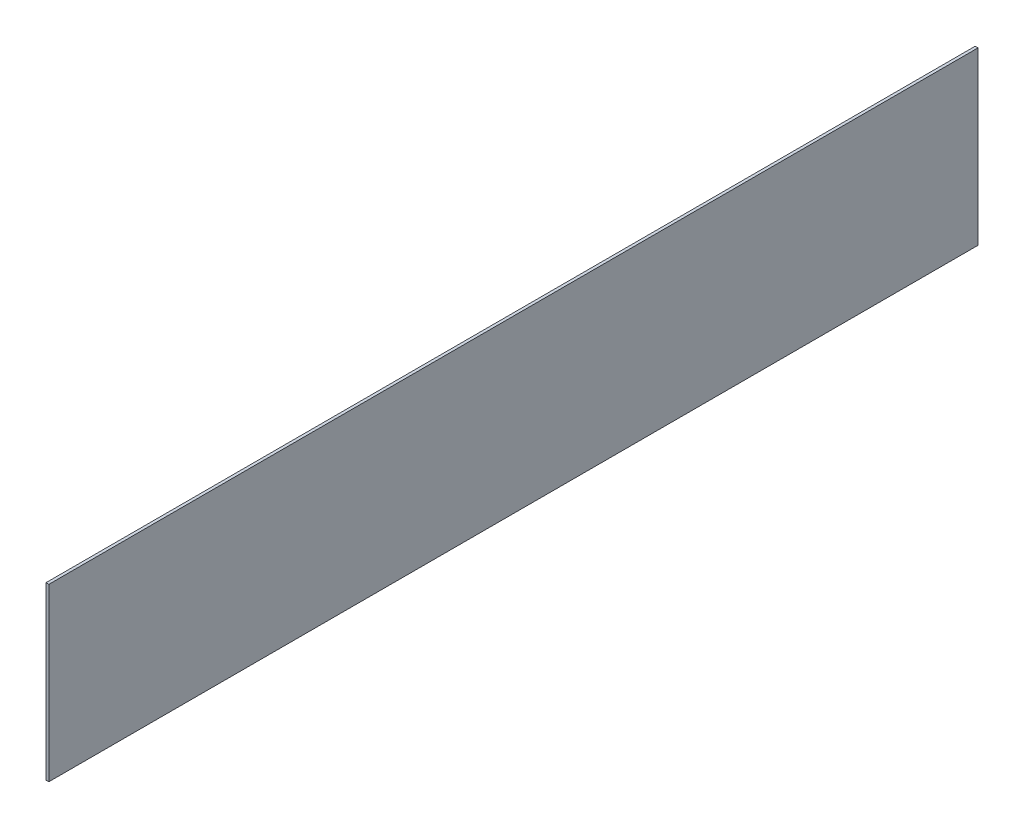
ISO-10303-21;
HEADER;
FILE_DESCRIPTION(('STEP AP214'),'2;1');
FILE_NAME('part.step','',(''),(''),'','','');
FILE_SCHEMA(('AUTOMOTIVE_DESIGN { 1 0 10303 214 1 1 1 1 }'));
ENDSEC;
DATA;
#1=APPLICATION_CONTEXT('core data for automotive mechanical design processes');
#2=APPLICATION_PROTOCOL_DEFINITION('international standard','automotive_design',2000,#1);
#3=PRODUCT_CONTEXT('',#1,'mechanical');
#4=PRODUCT('Part','Part','',(#3));
#5=PRODUCT_RELATED_PRODUCT_CATEGORY('part','',(#4));
#6=PRODUCT_DEFINITION_FORMATION('','',#4);
#7=PRODUCT_DEFINITION_CONTEXT('part definition',#1,'design');
#8=PRODUCT_DEFINITION('design','',#6,#7);
#9=PRODUCT_DEFINITION_SHAPE('','',#8);
#10=(LENGTH_UNIT() NAMED_UNIT(*) SI_UNIT(.MILLI.,.METRE.));
#11=(NAMED_UNIT(*) PLANE_ANGLE_UNIT() SI_UNIT($,.RADIAN.));
#12=(NAMED_UNIT(*) SI_UNIT($,.STERADIAN.) SOLID_ANGLE_UNIT());
#13=UNCERTAINTY_MEASURE_WITH_UNIT(LENGTH_MEASURE(1.E-05),#10,'distance_accuracy_value','');
#14=(GEOMETRIC_REPRESENTATION_CONTEXT(3) GLOBAL_UNCERTAINTY_ASSIGNED_CONTEXT((#13)) GLOBAL_UNIT_ASSIGNED_CONTEXT((#10,
#11,#12)) REPRESENTATION_CONTEXT('',''));
#15=CARTESIAN_POINT('',(0.,0.,0.));
#16=DIRECTION('',(0.,0.,1.));
#17=DIRECTION('',(1.,0.,0.));
#18=AXIS2_PLACEMENT_3D('',#15,#16,#17);
#19=CARTESIAN_POINT('',(1.,0.,0.));
#20=DIRECTION('',(0.,-1.,0.));
#21=DIRECTION('',(0.,0.,-1.));
#22=AXIS2_PLACEMENT_3D('',#19,#20,#21);
#23=PLANE('',#22);
#24=DIRECTION('',(0.,0.,1.));
#25=VECTOR('',#24,1.);
#26=CARTESIAN_POINT('',(0.,0.,0.));
#27=LINE('',#26,#25);
#28=CARTESIAN_POINT('',(0.,0.,-326.));
#29=VERTEX_POINT('',#28);
#30=CARTESIAN_POINT('',(0.,0.,0.));
#31=VERTEX_POINT('',#30);
#32=EDGE_CURVE('E109',#29,#31,#27,.T.);
#33=ORIENTED_EDGE('',*,*,#32,.F.);
#34=DIRECTION('',(-1.,0.,0.));
#35=VECTOR('',#34,1.);
#36=CARTESIAN_POINT('',(1.,0.,-326.));
#37=LINE('',#36,#35);
#38=CARTESIAN_POINT('',(1.,0.,-326.));
#39=VERTEX_POINT('',#38);
#40=EDGE_CURVE('E11',#39,#29,#37,.T.);
#41=ORIENTED_EDGE('',*,*,#40,.F.);
#42=DIRECTION('',(0.,0.,1.));
#43=VECTOR('',#42,1.);
#44=CARTESIAN_POINT('',(1.,0.,0.));
#45=LINE('',#44,#43);
#46=CARTESIAN_POINT('',(1.,0.,0.));
#47=VERTEX_POINT('',#46);
#48=EDGE_CURVE('E98',#39,#47,#45,.T.);
#49=ORIENTED_EDGE('',*,*,#48,.T.);
#50=DIRECTION('',(-1.,0.,0.));
#51=VECTOR('',#50,1.);
#52=CARTESIAN_POINT('',(1.,0.,0.));
#53=LINE('',#52,#51);
#54=EDGE_CURVE('E58',#47,#31,#53,.T.);
#55=ORIENTED_EDGE('',*,*,#54,.T.);
#56=EDGE_LOOP('',(#33,#41,#49,#55));
#57=FACE_BOUND('',#56,.T.);
#58=ADVANCED_FACE('F41',(#57),#23,.T.);
#59=CARTESIAN_POINT('',(1.,0.,-326.));
#60=DIRECTION('',(0.,0.,-1.));
#61=DIRECTION('',(-1.,0.,0.));
#62=AXIS2_PLACEMENT_3D('',#59,#60,#61);
#63=PLANE('',#62);
#64=DIRECTION('',(0.,-1.,0.));
#65=VECTOR('',#64,1.);
#66=CARTESIAN_POINT('',(0.,0.,-326.));
#67=LINE('',#66,#65);
#68=CARTESIAN_POINT('',(0.,60.,-326.));
#69=VERTEX_POINT('',#68);
#70=EDGE_CURVE('E88',#69,#29,#67,.T.);
#71=ORIENTED_EDGE('',*,*,#70,.F.);
#72=DIRECTION('',(-1.,0.,0.));
#73=VECTOR('',#72,1.);
#74=CARTESIAN_POINT('',(1.,60.,-326.));
#75=LINE('',#74,#73);
#76=CARTESIAN_POINT('',(1.,60.,-326.));
#77=VERTEX_POINT('',#76);
#78=EDGE_CURVE('E50',#77,#69,#75,.T.);
#79=ORIENTED_EDGE('',*,*,#78,.F.);
#80=DIRECTION('',(0.,-1.,0.));
#81=VECTOR('',#80,1.);
#82=CARTESIAN_POINT('',(1.,0.,-326.));
#83=LINE('',#82,#81);
#84=EDGE_CURVE('E86',#77,#39,#83,.T.);
#85=ORIENTED_EDGE('',*,*,#84,.T.);
#86=ORIENTED_EDGE('',*,*,#40,.T.);
#87=EDGE_LOOP('',(#71,#79,#85,#86));
#88=FACE_BOUND('',#87,.T.);
#89=ADVANCED_FACE('F85',(#88),#63,.T.);
#90=CARTESIAN_POINT('',(1.,60.,0.));
#91=DIRECTION('',(0.,1.,0.));
#92=DIRECTION('',(0.,0.,1.));
#93=AXIS2_PLACEMENT_3D('',#90,#91,#92);
#94=PLANE('',#93);
#95=DIRECTION('',(0.,0.,-1.));
#96=VECTOR('',#95,1.);
#97=CARTESIAN_POINT('',(0.,60.,0.));
#98=LINE('',#97,#96);
#99=CARTESIAN_POINT('',(0.,60.,0.));
#100=VERTEX_POINT('',#99);
#101=EDGE_CURVE('E114',#100,#69,#98,.T.);
#102=ORIENTED_EDGE('',*,*,#101,.F.);
#103=DIRECTION('',(-1.,0.,0.));
#104=VECTOR('',#103,1.);
#105=CARTESIAN_POINT('',(1.,60.,0.));
#106=LINE('',#105,#104);
#107=CARTESIAN_POINT('',(1.,60.,0.));
#108=VERTEX_POINT('',#107);
#109=EDGE_CURVE('E71',#108,#100,#106,.T.);
#110=ORIENTED_EDGE('',*,*,#109,.F.);
#111=DIRECTION('',(0.,0.,-1.));
#112=VECTOR('',#111,1.);
#113=CARTESIAN_POINT('',(1.,60.,0.));
#114=LINE('',#113,#112);
#115=EDGE_CURVE('E97',#108,#77,#114,.T.);
#116=ORIENTED_EDGE('',*,*,#115,.T.);
#117=ORIENTED_EDGE('',*,*,#78,.T.);
#118=EDGE_LOOP('',(#102,#110,#116,#117));
#119=FACE_BOUND('',#118,.T.);
#120=ADVANCED_FACE('F101',(#119),#94,.T.);
#121=CARTESIAN_POINT('',(1.,0.,0.));
#122=DIRECTION('',(0.,0.,1.));
#123=DIRECTION('',(1.,0.,0.));
#124=AXIS2_PLACEMENT_3D('',#121,#122,#123);
#125=PLANE('',#124);
#126=DIRECTION('',(0.,1.,0.));
#127=VECTOR('',#126,1.);
#128=CARTESIAN_POINT('',(0.,0.,0.));
#129=LINE('',#128,#127);
#130=EDGE_CURVE('E117',#31,#100,#129,.T.);
#131=ORIENTED_EDGE('',*,*,#130,.F.);
#132=ORIENTED_EDGE('',*,*,#54,.F.);
#133=DIRECTION('',(0.,1.,0.));
#134=VECTOR('',#133,1.);
#135=CARTESIAN_POINT('',(1.,0.,0.));
#136=LINE('',#135,#134);
#137=EDGE_CURVE('E103',#47,#108,#136,.T.);
#138=ORIENTED_EDGE('',*,*,#137,.T.);
#139=ORIENTED_EDGE('',*,*,#109,.T.);
#140=EDGE_LOOP('',(#131,#132,#138,#139));
#141=FACE_BOUND('',#140,.T.);
#142=ADVANCED_FACE('F126',(#141),#125,.T.);
#143=CARTESIAN_POINT('',(1.,0.,0.));
#144=DIRECTION('',(1.,0.,0.));
#145=DIRECTION('',(0.,0.,-1.));
#146=AXIS2_PLACEMENT_3D('',#143,#144,#145);
#147=PLANE('',#146);
#148=ORIENTED_EDGE('',*,*,#48,.F.);
#149=ORIENTED_EDGE('',*,*,#84,.F.);
#150=ORIENTED_EDGE('',*,*,#115,.F.);
#151=ORIENTED_EDGE('',*,*,#137,.F.);
#152=EDGE_LOOP('',(#148,#149,#150,#151));
#153=FACE_BOUND('',#152,.T.);
#154=ADVANCED_FACE('F95',(#153),#147,.T.);
#155=CARTESIAN_POINT('',(0.,0.,0.));
#156=DIRECTION('',(1.,0.,0.));
#157=DIRECTION('',(0.,0.,-1.));
#158=AXIS2_PLACEMENT_3D('',#155,#156,#157);
#159=PLANE('',#158);
#160=ORIENTED_EDGE('',*,*,#32,.T.);
#161=ORIENTED_EDGE('',*,*,#130,.T.);
#162=ORIENTED_EDGE('',*,*,#101,.T.);
#163=ORIENTED_EDGE('',*,*,#70,.T.);
#164=EDGE_LOOP('',(#160,#161,#162,#163));
#165=FACE_BOUND('',#164,.T.);
#166=ADVANCED_FACE('F133',(#165),#159,.F.);
#167=CLOSED_SHELL('',(#58,#89,#120,#142,#154,#166));
#168=MANIFOLD_SOLID_BREP('B2',#167);
#169=ADVANCED_BREP_SHAPE_REPRESENTATION('',(#18,#168),#14);
#170=SHAPE_DEFINITION_REPRESENTATION(#9,#169);
ENDSEC;
END-ISO-10303-21;
